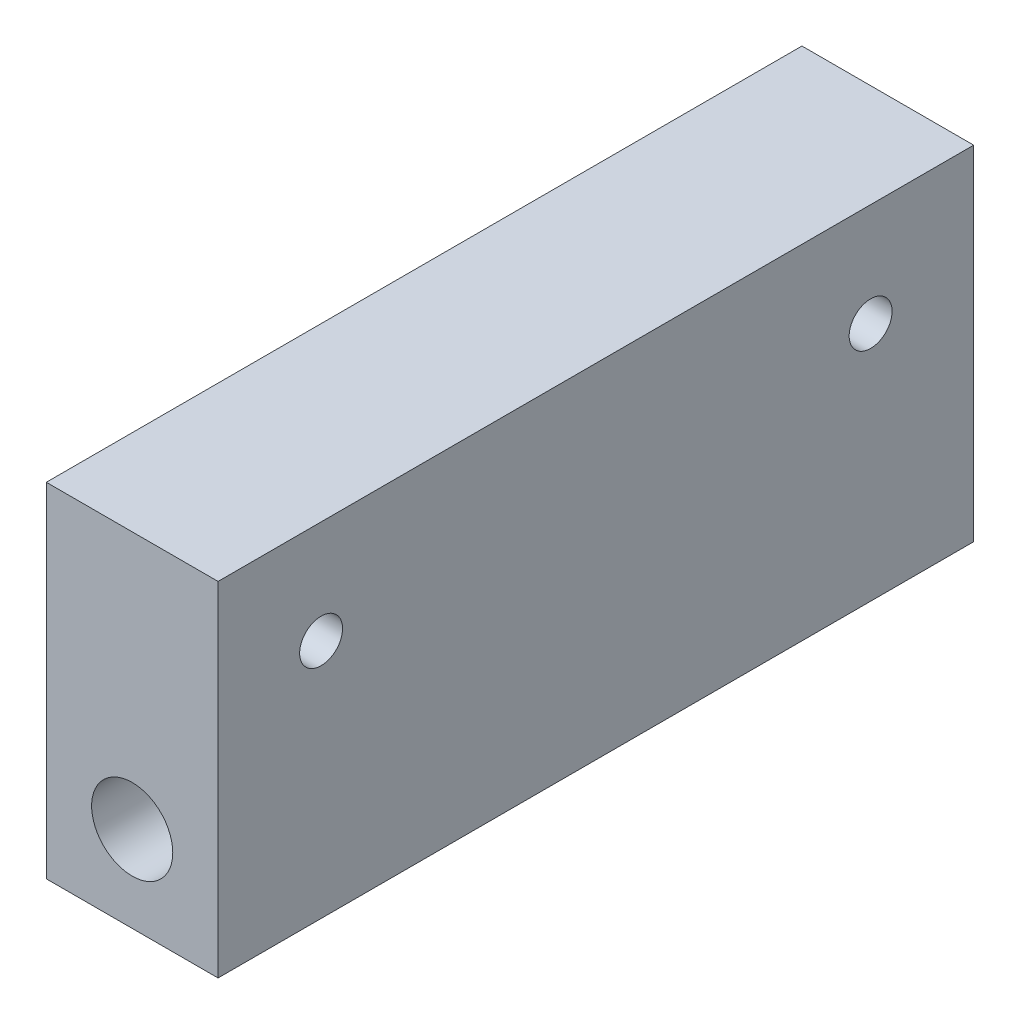
ISO-10303-21;
HEADER;
FILE_DESCRIPTION(('STEP AP214'),'2;1');
FILE_NAME('part.step','',(''),(''),'','','');
FILE_SCHEMA(('AUTOMOTIVE_DESIGN { 1 0 10303 214 1 1 1 1 }'));
ENDSEC;
DATA;
#1=APPLICATION_CONTEXT('core data for automotive mechanical design processes');
#2=APPLICATION_PROTOCOL_DEFINITION('international standard','automotive_design',2000,#1);
#3=PRODUCT_CONTEXT('',#1,'mechanical');
#4=PRODUCT('Part','Part','',(#3));
#5=PRODUCT_RELATED_PRODUCT_CATEGORY('part','',(#4));
#6=PRODUCT_DEFINITION_FORMATION('','',#4);
#7=PRODUCT_DEFINITION_CONTEXT('part definition',#1,'design');
#8=PRODUCT_DEFINITION('design','',#6,#7);
#9=PRODUCT_DEFINITION_SHAPE('','',#8);
#10=(LENGTH_UNIT() NAMED_UNIT(*) SI_UNIT(.MILLI.,.METRE.));
#11=(NAMED_UNIT(*) PLANE_ANGLE_UNIT() SI_UNIT($,.RADIAN.));
#12=(NAMED_UNIT(*) SI_UNIT($,.STERADIAN.) SOLID_ANGLE_UNIT());
#13=UNCERTAINTY_MEASURE_WITH_UNIT(LENGTH_MEASURE(1.E-05),#10,'distance_accuracy_value','');
#14=(GEOMETRIC_REPRESENTATION_CONTEXT(3) GLOBAL_UNCERTAINTY_ASSIGNED_CONTEXT((#13)) GLOBAL_UNIT_ASSIGNED_CONTEXT((#10,
#11,#12)) REPRESENTATION_CONTEXT('',''));
#15=CARTESIAN_POINT('',(0.,0.,0.));
#16=DIRECTION('',(0.,0.,1.));
#17=DIRECTION('',(1.,0.,0.));
#18=AXIS2_PLACEMENT_3D('',#15,#16,#17);
#19=CARTESIAN_POINT('',(0.,0.,-139.7));
#20=DIRECTION('',(-1.,0.,0.));
#21=DIRECTION('',(0.,0.,1.));
#22=AXIS2_PLACEMENT_3D('',#19,#20,#21);
#23=PLANE('',#22);
#24=CARTESIAN_POINT('',(0.,44.45,-120.65));
#25=DIRECTION('',(-1.,0.,0.));
#26=DIRECTION('',(0.,0.,1.));
#27=AXIS2_PLACEMENT_3D('',#24,#25,#26);
#28=CIRCLE('',#27,3.96874999999999);
#29=CARTESIAN_POINT('',(0.,44.45,-116.68125));
#30=VERTEX_POINT('',#29);
#31=EDGE_CURVE('E149',#30,#30,#28,.T.);
#32=ORIENTED_EDGE('',*,*,#31,.F.);
#33=EDGE_LOOP('',(#32));
#34=FACE_BOUND('',#33,.T.);
#35=CARTESIAN_POINT('',(0.,44.45,-19.05));
#36=DIRECTION('',(-1.,0.,0.));
#37=DIRECTION('',(0.,0.,1.));
#38=AXIS2_PLACEMENT_3D('',#35,#36,#37);
#39=CIRCLE('',#38,3.96875);
#40=CARTESIAN_POINT('',(0.,44.45,-15.08125));
#41=VERTEX_POINT('',#40);
#42=EDGE_CURVE('E159',#41,#41,#39,.T.);
#43=ORIENTED_EDGE('',*,*,#42,.F.);
#44=EDGE_LOOP('',(#43));
#45=FACE_BOUND('',#44,.T.);
#46=DIRECTION('',(0.,-1.,0.));
#47=VECTOR('',#46,1.);
#48=CARTESIAN_POINT('',(0.,0.,0.));
#49=LINE('',#48,#47);
#50=CARTESIAN_POINT('',(0.,63.5,0.));
#51=VERTEX_POINT('',#50);
#52=CARTESIAN_POINT('',(0.,0.,0.));
#53=VERTEX_POINT('',#52);
#54=EDGE_CURVE('E99',#51,#53,#49,.T.);
#55=ORIENTED_EDGE('',*,*,#54,.F.);
#56=DIRECTION('',(0.,0.,1.));
#57=VECTOR('',#56,1.);
#58=CARTESIAN_POINT('',(0.,63.5,-139.7));
#59=LINE('',#58,#57);
#60=CARTESIAN_POINT('',(0.,63.5,-139.7));
#61=VERTEX_POINT('',#60);
#62=EDGE_CURVE('E11',#61,#51,#59,.T.);
#63=ORIENTED_EDGE('',*,*,#62,.F.);
#64=DIRECTION('',(0.,-1.,0.));
#65=VECTOR('',#64,1.);
#66=CARTESIAN_POINT('',(0.,0.,-139.7));
#67=LINE('',#66,#65);
#68=CARTESIAN_POINT('',(0.,0.,-139.7));
#69=VERTEX_POINT('',#68);
#70=EDGE_CURVE('E92',#61,#69,#67,.T.);
#71=ORIENTED_EDGE('',*,*,#70,.T.);
#72=DIRECTION('',(0.,0.,1.));
#73=VECTOR('',#72,1.);
#74=CARTESIAN_POINT('',(0.,0.,-139.7));
#75=LINE('',#74,#73);
#76=EDGE_CURVE('E37',#69,#53,#75,.T.);
#77=ORIENTED_EDGE('',*,*,#76,.T.);
#78=EDGE_LOOP('',(#55,#63,#71,#77));
#79=FACE_BOUND('',#78,.T.);
#80=ADVANCED_FACE('F34',(#34,#45,#79),#23,.T.);
#81=CARTESIAN_POINT('',(0.,63.5,-139.7));
#82=DIRECTION('',(0.,1.,0.));
#83=DIRECTION('',(0.,0.,1.));
#84=AXIS2_PLACEMENT_3D('',#81,#82,#83);
#85=PLANE('',#84);
#86=DIRECTION('',(-1.,0.,0.));
#87=VECTOR('',#86,1.);
#88=CARTESIAN_POINT('',(0.,63.5,0.));
#89=LINE('',#88,#87);
#90=CARTESIAN_POINT('',(31.75,63.5,0.));
#91=VERTEX_POINT('',#90);
#92=EDGE_CURVE('E94',#91,#51,#89,.T.);
#93=ORIENTED_EDGE('',*,*,#92,.F.);
#94=DIRECTION('',(0.,0.,1.));
#95=VECTOR('',#94,1.);
#96=CARTESIAN_POINT('',(31.75,63.5,-139.7));
#97=LINE('',#96,#95);
#98=CARTESIAN_POINT('',(31.75,63.5,-139.7));
#99=VERTEX_POINT('',#98);
#100=EDGE_CURVE('E43',#99,#91,#97,.T.);
#101=ORIENTED_EDGE('',*,*,#100,.F.);
#102=DIRECTION('',(-1.,0.,0.));
#103=VECTOR('',#102,1.);
#104=CARTESIAN_POINT('',(0.,63.5,-139.7));
#105=LINE('',#104,#103);
#106=EDGE_CURVE('E89',#99,#61,#105,.T.);
#107=ORIENTED_EDGE('',*,*,#106,.T.);
#108=ORIENTED_EDGE('',*,*,#62,.T.);
#109=EDGE_LOOP('',(#93,#101,#107,#108));
#110=FACE_BOUND('',#109,.T.);
#111=ADVANCED_FACE('F110',(#110),#85,.T.);
#112=CARTESIAN_POINT('',(31.75,0.,-139.7));
#113=DIRECTION('',(1.,0.,0.));
#114=DIRECTION('',(0.,0.,-1.));
#115=AXIS2_PLACEMENT_3D('',#112,#113,#114);
#116=PLANE('',#115);
#117=CARTESIAN_POINT('',(31.75,44.45,-120.65));
#118=DIRECTION('',(1.,0.,0.));
#119=DIRECTION('',(0.,0.,-1.));
#120=AXIS2_PLACEMENT_3D('',#117,#118,#119);
#121=CIRCLE('',#120,3.96874999999999);
#122=CARTESIAN_POINT('',(31.75,44.45,-124.61875));
#123=VERTEX_POINT('',#122);
#124=EDGE_CURVE('E152',#123,#123,#121,.T.);
#125=ORIENTED_EDGE('',*,*,#124,.F.);
#126=EDGE_LOOP('',(#125));
#127=FACE_BOUND('',#126,.T.);
#128=CARTESIAN_POINT('',(31.75,44.45,-19.05));
#129=DIRECTION('',(1.,0.,0.));
#130=DIRECTION('',(0.,0.,-1.));
#131=AXIS2_PLACEMENT_3D('',#128,#129,#130);
#132=CIRCLE('',#131,3.96875);
#133=CARTESIAN_POINT('',(31.75,44.45,-23.01875));
#134=VERTEX_POINT('',#133);
#135=EDGE_CURVE('E154',#134,#134,#132,.T.);
#136=ORIENTED_EDGE('',*,*,#135,.F.);
#137=EDGE_LOOP('',(#136));
#138=FACE_BOUND('',#137,.T.);
#139=DIRECTION('',(0.,1.,0.));
#140=VECTOR('',#139,1.);
#141=CARTESIAN_POINT('',(31.75,0.,0.));
#142=LINE('',#141,#140);
#143=CARTESIAN_POINT('',(31.75,0.,0.));
#144=VERTEX_POINT('',#143);
#145=EDGE_CURVE('E84',#144,#91,#142,.T.);
#146=ORIENTED_EDGE('',*,*,#145,.F.);
#147=DIRECTION('',(0.,0.,1.));
#148=VECTOR('',#147,1.);
#149=CARTESIAN_POINT('',(31.75,0.,-139.7));
#150=LINE('',#149,#148);
#151=CARTESIAN_POINT('',(31.75,0.,-139.7));
#152=VERTEX_POINT('',#151);
#153=EDGE_CURVE('E79',#152,#144,#150,.T.);
#154=ORIENTED_EDGE('',*,*,#153,.F.);
#155=DIRECTION('',(0.,1.,0.));
#156=VECTOR('',#155,1.);
#157=CARTESIAN_POINT('',(31.75,0.,-139.7));
#158=LINE('',#157,#156);
#159=EDGE_CURVE('E82',#152,#99,#158,.T.);
#160=ORIENTED_EDGE('',*,*,#159,.T.);
#161=ORIENTED_EDGE('',*,*,#100,.T.);
#162=EDGE_LOOP('',(#146,#154,#160,#161));
#163=FACE_BOUND('',#162,.T.);
#164=ADVANCED_FACE('F81',(#127,#138,#163),#116,.T.);
#165=CARTESIAN_POINT('',(0.,0.,-139.7));
#166=DIRECTION('',(0.,-1.,0.));
#167=DIRECTION('',(0.,0.,-1.));
#168=AXIS2_PLACEMENT_3D('',#165,#166,#167);
#169=PLANE('',#168);
#170=DIRECTION('',(1.,0.,0.));
#171=VECTOR('',#170,1.);
#172=CARTESIAN_POINT('',(0.,0.,0.));
#173=LINE('',#172,#171);
#174=EDGE_CURVE('E102',#53,#144,#173,.T.);
#175=ORIENTED_EDGE('',*,*,#174,.F.);
#176=ORIENTED_EDGE('',*,*,#76,.F.);
#177=DIRECTION('',(1.,0.,0.));
#178=VECTOR('',#177,1.);
#179=CARTESIAN_POINT('',(0.,0.,-139.7));
#180=LINE('',#179,#178);
#181=EDGE_CURVE('E88',#69,#152,#180,.T.);
#182=ORIENTED_EDGE('',*,*,#181,.T.);
#183=ORIENTED_EDGE('',*,*,#153,.T.);
#184=EDGE_LOOP('',(#175,#176,#182,#183));
#185=FACE_BOUND('',#184,.T.);
#186=ADVANCED_FACE('F91',(#185),#169,.T.);
#187=CARTESIAN_POINT('',(0.,0.,-139.7));
#188=DIRECTION('',(0.,0.,-1.));
#189=DIRECTION('',(-1.,0.,0.));
#190=AXIS2_PLACEMENT_3D('',#187,#188,#189);
#191=PLANE('',#190);
#192=CARTESIAN_POINT('',(15.875,15.875,-139.7));
#193=DIRECTION('',(0.,0.,1.));
#194=DIRECTION('',(1.,0.,0.));
#195=AXIS2_PLACEMENT_3D('',#192,#193,#194);
#196=CIRCLE('',#195,7.5);
#197=CARTESIAN_POINT('',(23.375,15.875,-139.7));
#198=VERTEX_POINT('',#197);
#199=EDGE_CURVE('E103',#198,#198,#196,.T.);
#200=ORIENTED_EDGE('',*,*,#199,.T.);
#201=EDGE_LOOP('',(#200));
#202=FACE_BOUND('',#201,.T.);
#203=ORIENTED_EDGE('',*,*,#70,.F.);
#204=ORIENTED_EDGE('',*,*,#106,.F.);
#205=ORIENTED_EDGE('',*,*,#159,.F.);
#206=ORIENTED_EDGE('',*,*,#181,.F.);
#207=EDGE_LOOP('',(#203,#204,#205,#206));
#208=FACE_BOUND('',#207,.T.);
#209=ADVANCED_FACE('F87',(#202,#208),#191,.T.);
#210=CARTESIAN_POINT('',(0.,0.,0.));
#211=DIRECTION('',(0.,0.,-1.));
#212=DIRECTION('',(-1.,0.,0.));
#213=AXIS2_PLACEMENT_3D('',#210,#211,#212);
#214=PLANE('',#213);
#215=CARTESIAN_POINT('',(15.875,15.875,0.));
#216=DIRECTION('',(0.,0.,1.));
#217=DIRECTION('',(1.,0.,0.));
#218=AXIS2_PLACEMENT_3D('',#215,#216,#217);
#219=CIRCLE('',#218,7.5);
#220=CARTESIAN_POINT('',(23.375,15.875,0.));
#221=VERTEX_POINT('',#220);
#222=EDGE_CURVE('E162',#221,#221,#219,.T.);
#223=ORIENTED_EDGE('',*,*,#222,.F.);
#224=EDGE_LOOP('',(#223));
#225=FACE_BOUND('',#224,.T.);
#226=ORIENTED_EDGE('',*,*,#54,.T.);
#227=ORIENTED_EDGE('',*,*,#174,.T.);
#228=ORIENTED_EDGE('',*,*,#145,.T.);
#229=ORIENTED_EDGE('',*,*,#92,.T.);
#230=EDGE_LOOP('',(#226,#227,#228,#229));
#231=FACE_BOUND('',#230,.T.);
#232=ADVANCED_FACE('F109',(#225,#231),#214,.F.);
#233=CARTESIAN_POINT('',(15.875,15.875,-139.7));
#234=DIRECTION('',(0.,0.,1.));
#235=DIRECTION('',(1.,0.,0.));
#236=AXIS2_PLACEMENT_3D('',#233,#234,#235);
#237=CYLINDRICAL_SURFACE('',#236,7.5);
#238=ORIENTED_EDGE('',*,*,#199,.F.);
#239=EDGE_LOOP('',(#238));
#240=FACE_BOUND('',#239,.T.);
#241=ORIENTED_EDGE('',*,*,#222,.T.);
#242=EDGE_LOOP('',(#241));
#243=FACE_BOUND('',#242,.T.);
#244=ADVANCED_FACE('F130',(#240,#243),#237,.F.);
#245=CARTESIAN_POINT('',(-107.95,44.45,-19.05));
#246=DIRECTION('',(1.,0.,0.));
#247=DIRECTION('',(0.,0.,-1.));
#248=AXIS2_PLACEMENT_3D('',#245,#246,#247);
#249=CYLINDRICAL_SURFACE('',#248,3.96875);
#250=ORIENTED_EDGE('',*,*,#42,.T.);
#251=EDGE_LOOP('',(#250));
#252=FACE_BOUND('',#251,.T.);
#253=ORIENTED_EDGE('',*,*,#135,.T.);
#254=EDGE_LOOP('',(#253));
#255=FACE_BOUND('',#254,.T.);
#256=ADVANCED_FACE('F136',(#252,#255),#249,.F.);
#257=CARTESIAN_POINT('',(-107.95,44.45,-120.65));
#258=DIRECTION('',(1.,0.,0.));
#259=DIRECTION('',(0.,0.,-1.));
#260=AXIS2_PLACEMENT_3D('',#257,#258,#259);
#261=CYLINDRICAL_SURFACE('',#260,3.96874999999999);
#262=ORIENTED_EDGE('',*,*,#31,.T.);
#263=EDGE_LOOP('',(#262));
#264=FACE_BOUND('',#263,.T.);
#265=ORIENTED_EDGE('',*,*,#124,.T.);
#266=EDGE_LOOP('',(#265));
#267=FACE_BOUND('',#266,.T.);
#268=ADVANCED_FACE('F140',(#264,#267),#261,.F.);
#269=CLOSED_SHELL('',(#80,#111,#164,#186,#209,#232,#244,#256,#268));
#270=MANIFOLD_SOLID_BREP('B2',#269);
#271=ADVANCED_BREP_SHAPE_REPRESENTATION('',(#18,#270),#14);
#272=SHAPE_DEFINITION_REPRESENTATION(#9,#271);
ENDSEC;
END-ISO-10303-21;
